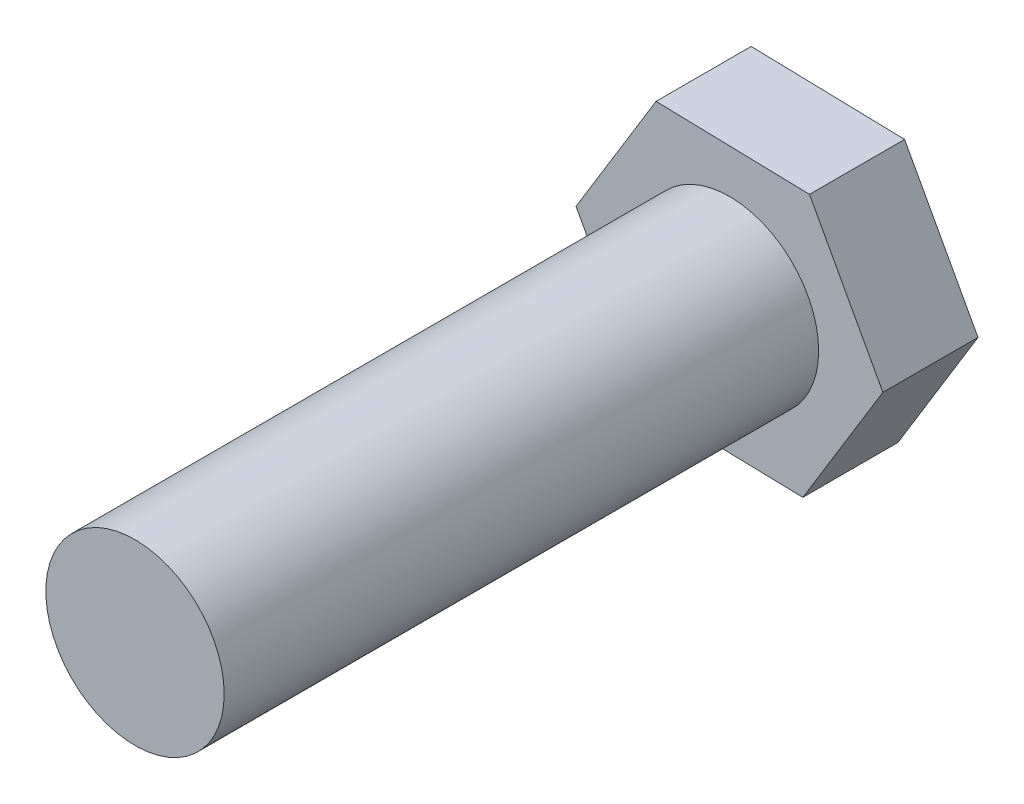
ISO-10303-21;
HEADER;
FILE_DESCRIPTION(('STEP AP214'),'2;1');
FILE_NAME('part.step','',(''),(''),'','','');
FILE_SCHEMA(('AUTOMOTIVE_DESIGN { 1 0 10303 214 1 1 1 1 }'));
ENDSEC;
DATA;
#1=APPLICATION_CONTEXT('core data for automotive mechanical design processes');
#2=APPLICATION_PROTOCOL_DEFINITION('international standard','automotive_design',2000,#1);
#3=PRODUCT_CONTEXT('',#1,'mechanical');
#4=PRODUCT('Part','Part','',(#3));
#5=PRODUCT_RELATED_PRODUCT_CATEGORY('part','',(#4));
#6=PRODUCT_DEFINITION_FORMATION('','',#4);
#7=PRODUCT_DEFINITION_CONTEXT('part definition',#1,'design');
#8=PRODUCT_DEFINITION('design','',#6,#7);
#9=PRODUCT_DEFINITION_SHAPE('','',#8);
#10=(LENGTH_UNIT() NAMED_UNIT(*) SI_UNIT(.MILLI.,.METRE.));
#11=(NAMED_UNIT(*) PLANE_ANGLE_UNIT() SI_UNIT($,.RADIAN.));
#12=(NAMED_UNIT(*) SI_UNIT($,.STERADIAN.) SOLID_ANGLE_UNIT());
#13=UNCERTAINTY_MEASURE_WITH_UNIT(LENGTH_MEASURE(1.E-05),#10,'distance_accuracy_value','');
#14=(GEOMETRIC_REPRESENTATION_CONTEXT(3) GLOBAL_UNCERTAINTY_ASSIGNED_CONTEXT((#13)) GLOBAL_UNIT_ASSIGNED_CONTEXT((#10,
#11,#12)) REPRESENTATION_CONTEXT('',''));
#15=CARTESIAN_POINT('',(0.,0.,0.));
#16=DIRECTION('',(0.,0.,1.));
#17=DIRECTION('',(1.,0.,0.));
#18=AXIS2_PLACEMENT_3D('',#15,#16,#17);
#19=CARTESIAN_POINT('',(8.19500512713272,-0.204869762536447,36.83));
#20=DIRECTION('',(-0.878250680315167,-0.478200525434619,0.));
#21=DIRECTION('',(0.478200525434619,-0.878250680315167,0.));
#22=AXIS2_PLACEMENT_3D('',#19,#20,#21);
#23=PLANE('',#22);
#24=DIRECTION('',(-0.478200525434619,0.878250680315167,0.));
#25=VECTOR('',#24,1.);
#26=CARTESIAN_POINT('',(8.19500512713272,-0.204869762536447,5.07999999999999));
#27=LINE('',#26,#25);
#28=CARTESIAN_POINT('',(8.19500512713272,-0.204869762536447,5.07999999999999));
#29=VERTEX_POINT('',#28);
#30=CARTESIAN_POINT('',(4.27492498239021,6.99464774297243,5.07999999999999));
#31=VERTEX_POINT('',#30);
#32=EDGE_CURVE('E89',#29,#31,#27,.T.);
#33=ORIENTED_EDGE('',*,*,#32,.F.);
#34=DIRECTION('',(0.,0.,-1.));
#35=VECTOR('',#34,1.);
#36=CARTESIAN_POINT('',(8.19500512713272,-0.204869762536447,36.83));
#37=LINE('',#36,#35);
#38=CARTESIAN_POINT('',(8.19500512713272,-0.204869762536447,0.));
#39=VERTEX_POINT('',#38);
#40=EDGE_CURVE('E59',#29,#39,#37,.T.);
#41=ORIENTED_EDGE('',*,*,#40,.T.);
#42=DIRECTION('',(-0.478200525434619,0.878250680315167,0.));
#43=VECTOR('',#42,1.);
#44=CARTESIAN_POINT('',(8.19500512713272,-0.204869762536447,0.));
#45=LINE('',#44,#43);
#46=CARTESIAN_POINT('',(4.27492498239021,6.99464774297243,0.));
#47=VERTEX_POINT('',#46);
#48=EDGE_CURVE('E94',#39,#47,#45,.T.);
#49=ORIENTED_EDGE('',*,*,#48,.T.);
#50=DIRECTION('',(0.,0.,-1.));
#51=VECTOR('',#50,1.);
#52=CARTESIAN_POINT('',(4.27492498239021,6.99464774297243,36.83));
#53=LINE('',#52,#51);
#54=EDGE_CURVE('E45',#31,#47,#53,.T.);
#55=ORIENTED_EDGE('',*,*,#54,.F.);
#56=EDGE_LOOP('',(#33,#41,#49,#55));
#57=FACE_BOUND('',#56,.T.);
#58=ADVANCED_FACE('F38',(#57),#23,.F.);
#59=CARTESIAN_POINT('',(4.27492498239021,6.99464774297243,36.83));
#60=DIRECTION('',(-0.0249915370281369,-0.99968766276121,0.));
#61=DIRECTION('',(0.99968766276121,-0.0249915370281369,0.));
#62=AXIS2_PLACEMENT_3D('',#59,#60,#61);
#63=PLANE('',#62);
#64=DIRECTION('',(-0.99968766276121,0.0249915370281369,0.));
#65=VECTOR('',#64,1.);
#66=CARTESIAN_POINT('',(4.27492498239021,6.99464774297243,5.07999999999999));
#67=LINE('',#66,#65);
#68=CARTESIAN_POINT('',(-3.92008014474251,7.19951750550889,5.07999999999999));
#69=VERTEX_POINT('',#68);
#70=EDGE_CURVE('E95',#31,#69,#67,.T.);
#71=ORIENTED_EDGE('',*,*,#70,.F.);
#72=ORIENTED_EDGE('',*,*,#54,.T.);
#73=DIRECTION('',(-0.99968766276121,0.0249915370281369,0.));
#74=VECTOR('',#73,1.);
#75=CARTESIAN_POINT('',(4.27492498239021,6.99464774297243,0.));
#76=LINE('',#75,#74);
#77=CARTESIAN_POINT('',(-3.92008014474251,7.19951750550889,0.));
#78=VERTEX_POINT('',#77);
#79=EDGE_CURVE('E118',#47,#78,#76,.T.);
#80=ORIENTED_EDGE('',*,*,#79,.T.);
#81=DIRECTION('',(0.,0.,-1.));
#82=VECTOR('',#81,1.);
#83=CARTESIAN_POINT('',(-3.92008014474251,7.19951750550889,36.83));
#84=LINE('',#83,#82);
#85=EDGE_CURVE('E112',#69,#78,#84,.T.);
#86=ORIENTED_EDGE('',*,*,#85,.F.);
#87=EDGE_LOOP('',(#71,#72,#80,#86));
#88=FACE_BOUND('',#87,.T.);
#89=ADVANCED_FACE('F116',(#88),#63,.F.);
#90=CARTESIAN_POINT('',(-3.92008014474251,7.19951750550889,36.83));
#91=DIRECTION('',(0.853259143287031,-0.521487137326591,0.));
#92=DIRECTION('',(0.521487137326591,0.853259143287031,0.));
#93=AXIS2_PLACEMENT_3D('',#90,#91,#92);
#94=PLANE('',#93);
#95=DIRECTION('',(-0.521487137326591,-0.853259143287031,0.));
#96=VECTOR('',#95,1.);
#97=CARTESIAN_POINT('',(-3.92008014474251,7.19951750550889,5.07999999999999));
#98=LINE('',#97,#96);
#99=CARTESIAN_POINT('',(-8.19500512713272,0.204869762536445,5.07999999999999));
#100=VERTEX_POINT('',#99);
#101=EDGE_CURVE('E145',#69,#100,#98,.T.);
#102=ORIENTED_EDGE('',*,*,#101,.F.);
#103=ORIENTED_EDGE('',*,*,#85,.T.);
#104=DIRECTION('',(-0.521487137326591,-0.853259143287031,0.));
#105=VECTOR('',#104,1.);
#106=CARTESIAN_POINT('',(-3.92008014474251,7.19951750550889,0.));
#107=LINE('',#106,#105);
#108=CARTESIAN_POINT('',(-8.19500512713272,0.204869762536445,0.));
#109=VERTEX_POINT('',#108);
#110=EDGE_CURVE('E124',#78,#109,#107,.T.);
#111=ORIENTED_EDGE('',*,*,#110,.T.);
#112=DIRECTION('',(0.,0.,-1.));
#113=VECTOR('',#112,1.);
#114=CARTESIAN_POINT('',(-8.19500512713272,0.204869762536445,36.83));
#115=LINE('',#114,#113);
#116=EDGE_CURVE('E110',#100,#109,#115,.T.);
#117=ORIENTED_EDGE('',*,*,#116,.F.);
#118=EDGE_LOOP('',(#102,#103,#111,#117));
#119=FACE_BOUND('',#118,.T.);
#120=ADVANCED_FACE('F144',(#119),#94,.F.);
#121=CARTESIAN_POINT('',(-8.19500512713272,0.204869762536445,36.83));
#122=DIRECTION('',(0.878250680315167,0.47820052543462,0.));
#123=DIRECTION('',(-0.47820052543462,0.878250680315167,0.));
#124=AXIS2_PLACEMENT_3D('',#121,#122,#123);
#125=PLANE('',#124);
#126=DIRECTION('',(0.47820052543462,-0.878250680315167,0.));
#127=VECTOR('',#126,1.);
#128=CARTESIAN_POINT('',(-8.19500512713272,0.204869762536445,5.07999999999999));
#129=LINE('',#128,#127);
#130=CARTESIAN_POINT('',(-4.27492498239021,-6.99464774297244,5.07999999999999));
#131=VERTEX_POINT('',#130);
#132=EDGE_CURVE('E141',#100,#131,#129,.T.);
#133=ORIENTED_EDGE('',*,*,#132,.F.);
#134=ORIENTED_EDGE('',*,*,#116,.T.);
#135=DIRECTION('',(0.47820052543462,-0.878250680315167,0.));
#136=VECTOR('',#135,1.);
#137=CARTESIAN_POINT('',(-8.19500512713272,0.204869762536445,0.));
#138=LINE('',#137,#136);
#139=CARTESIAN_POINT('',(-4.27492498239021,-6.99464774297244,0.));
#140=VERTEX_POINT('',#139);
#141=EDGE_CURVE('E130',#109,#140,#138,.T.);
#142=ORIENTED_EDGE('',*,*,#141,.T.);
#143=DIRECTION('',(0.,0.,-1.));
#144=VECTOR('',#143,1.);
#145=CARTESIAN_POINT('',(-4.27492498239021,-6.99464774297244,36.83));
#146=LINE('',#145,#144);
#147=EDGE_CURVE('E103',#131,#140,#146,.T.);
#148=ORIENTED_EDGE('',*,*,#147,.F.);
#149=EDGE_LOOP('',(#133,#134,#142,#148));
#150=FACE_BOUND('',#149,.T.);
#151=ADVANCED_FACE('F139',(#150),#125,.F.);
#152=CARTESIAN_POINT('',(-4.27492498239021,-6.99464774297244,36.83));
#153=DIRECTION('',(0.0249915370281367,0.99968766276121,0.));
#154=DIRECTION('',(-0.99968766276121,0.0249915370281367,0.));
#155=AXIS2_PLACEMENT_3D('',#152,#153,#154);
#156=PLANE('',#155);
#157=DIRECTION('',(0.99968766276121,-0.0249915370281367,0.));
#158=VECTOR('',#157,1.);
#159=CARTESIAN_POINT('',(-4.27492498239021,-6.99464774297244,5.07999999999999));
#160=LINE('',#159,#158);
#161=CARTESIAN_POINT('',(3.92008014474251,-7.19951750550889,5.07999999999999));
#162=VERTEX_POINT('',#161);
#163=EDGE_CURVE('E51',#131,#162,#160,.T.);
#164=ORIENTED_EDGE('',*,*,#163,.F.);
#165=ORIENTED_EDGE('',*,*,#147,.T.);
#166=DIRECTION('',(0.99968766276121,-0.0249915370281367,0.));
#167=VECTOR('',#166,1.);
#168=CARTESIAN_POINT('',(-4.27492498239021,-6.99464774297244,0.));
#169=LINE('',#168,#167);
#170=CARTESIAN_POINT('',(3.92008014474251,-7.19951750550889,0.));
#171=VERTEX_POINT('',#170);
#172=EDGE_CURVE('E105',#140,#171,#169,.T.);
#173=ORIENTED_EDGE('',*,*,#172,.T.);
#174=DIRECTION('',(0.,0.,-1.));
#175=VECTOR('',#174,1.);
#176=CARTESIAN_POINT('',(3.92008014474251,-7.19951750550889,36.83));
#177=LINE('',#176,#175);
#178=EDGE_CURVE('E101',#162,#171,#177,.T.);
#179=ORIENTED_EDGE('',*,*,#178,.F.);
#180=EDGE_LOOP('',(#164,#165,#173,#179));
#181=FACE_BOUND('',#180,.T.);
#182=ADVANCED_FACE('F135',(#181),#156,.F.);
#183=CARTESIAN_POINT('',(3.92008014474251,-7.19951750550889,36.83));
#184=DIRECTION('',(-0.853259143287031,0.521487137326591,0.));
#185=DIRECTION('',(-0.521487137326591,-0.853259143287031,0.));
#186=AXIS2_PLACEMENT_3D('',#183,#184,#185);
#187=PLANE('',#186);
#188=DIRECTION('',(0.521487137326591,0.853259143287031,0.));
#189=VECTOR('',#188,1.);
#190=CARTESIAN_POINT('',(3.92008014474251,-7.19951750550889,5.07999999999999));
#191=LINE('',#190,#189);
#192=EDGE_CURVE('E12',#162,#29,#191,.T.);
#193=ORIENTED_EDGE('',*,*,#192,.F.);
#194=ORIENTED_EDGE('',*,*,#178,.T.);
#195=DIRECTION('',(0.521487137326591,0.85325914328703,0.));
#196=VECTOR('',#195,1.);
#197=CARTESIAN_POINT('',(3.92008014474251,-7.19951750550889,0.));
#198=LINE('',#197,#196);
#199=EDGE_CURVE('E99',#171,#39,#198,.T.);
#200=ORIENTED_EDGE('',*,*,#199,.T.);
#201=ORIENTED_EDGE('',*,*,#40,.F.);
#202=EDGE_LOOP('',(#193,#194,#200,#201));
#203=FACE_BOUND('',#202,.T.);
#204=ADVANCED_FACE('F97',(#203),#187,.F.);
#205=CARTESIAN_POINT('',(4.27492498239021,6.99464774297243,0.));
#206=DIRECTION('',(0.,0.,1.));
#207=DIRECTION('',(1.,0.,0.));
#208=AXIS2_PLACEMENT_3D('',#205,#206,#207);
#209=PLANE('',#208);
#210=ORIENTED_EDGE('',*,*,#48,.F.);
#211=ORIENTED_EDGE('',*,*,#199,.F.);
#212=ORIENTED_EDGE('',*,*,#172,.F.);
#213=ORIENTED_EDGE('',*,*,#141,.F.);
#214=ORIENTED_EDGE('',*,*,#110,.F.);
#215=ORIENTED_EDGE('',*,*,#79,.F.);
#216=EDGE_LOOP('',(#210,#211,#212,#213,#214,#215));
#217=FACE_BOUND('',#216,.T.);
#218=ADVANCED_FACE('F121',(#217),#209,.F.);
#219=CARTESIAN_POINT('',(0.,0.,5.07999999999999));
#220=DIRECTION('',(0.,0.,1.));
#221=DIRECTION('',(1.,0.,0.));
#222=AXIS2_PLACEMENT_3D('',#219,#220,#221);
#223=PLANE('',#222);
#224=CARTESIAN_POINT('',(0.,0.,5.07999999999999));
#225=DIRECTION('',(0.,0.,1.));
#226=DIRECTION('',(1.,0.,0.));
#227=AXIS2_PLACEMENT_3D('',#224,#225,#226);
#228=CIRCLE('',#227,4.7625);
#229=CARTESIAN_POINT('',(4.7625,0.,5.07999999999999));
#230=VERTEX_POINT('',#229);
#231=EDGE_CURVE('E150',#230,#230,#228,.T.);
#232=ORIENTED_EDGE('',*,*,#231,.F.);
#233=EDGE_LOOP('',(#232));
#234=FACE_BOUND('',#233,.T.);
#235=ORIENTED_EDGE('',*,*,#32,.T.);
#236=ORIENTED_EDGE('',*,*,#70,.T.);
#237=ORIENTED_EDGE('',*,*,#101,.T.);
#238=ORIENTED_EDGE('',*,*,#132,.T.);
#239=ORIENTED_EDGE('',*,*,#163,.T.);
#240=ORIENTED_EDGE('',*,*,#192,.T.);
#241=EDGE_LOOP('',(#235,#236,#237,#238,#239,#240));
#242=FACE_BOUND('',#241,.T.);
#243=ADVANCED_FACE('F88',(#234,#242),#223,.T.);
#244=CARTESIAN_POINT('',(0.,0.,5.07999999999999));
#245=DIRECTION('',(0.,0.,1.));
#246=DIRECTION('',(1.,0.,0.));
#247=AXIS2_PLACEMENT_3D('',#244,#245,#246);
#248=CYLINDRICAL_SURFACE('',#247,4.7625);
#249=ORIENTED_EDGE('',*,*,#231,.T.);
#250=EDGE_LOOP('',(#249));
#251=FACE_BOUND('',#250,.T.);
#252=CARTESIAN_POINT('',(0.,0.,36.83));
#253=DIRECTION('',(0.,0.,1.));
#254=DIRECTION('',(1.,0.,0.));
#255=AXIS2_PLACEMENT_3D('',#252,#253,#254);
#256=CIRCLE('',#255,4.7625);
#257=CARTESIAN_POINT('',(4.7625,0.,36.83));
#258=VERTEX_POINT('',#257);
#259=EDGE_CURVE('E151',#258,#258,#256,.T.);
#260=ORIENTED_EDGE('',*,*,#259,.F.);
#261=EDGE_LOOP('',(#260));
#262=FACE_BOUND('',#261,.T.);
#263=ADVANCED_FACE('F157',(#251,#262),#248,.T.);
#264=CARTESIAN_POINT('',(4.27492498239021,6.99464774297243,36.83));
#265=DIRECTION('',(0.,0.,1.));
#266=DIRECTION('',(1.,0.,0.));
#267=AXIS2_PLACEMENT_3D('',#264,#265,#266);
#268=PLANE('',#267);
#269=ORIENTED_EDGE('',*,*,#259,.T.);
#270=EDGE_LOOP('',(#269));
#271=FACE_BOUND('',#270,.T.);
#272=ADVANCED_FACE('F166',(#271),#268,.T.);
#273=CLOSED_SHELL('',(#58,#89,#120,#151,#182,#204,#218,#243,#263,#272));
#274=MANIFOLD_SOLID_BREP('B2',#273);
#275=ADVANCED_BREP_SHAPE_REPRESENTATION('',(#18,#274),#14);
#276=SHAPE_DEFINITION_REPRESENTATION(#9,#275);
ENDSEC;
END-ISO-10303-21;
